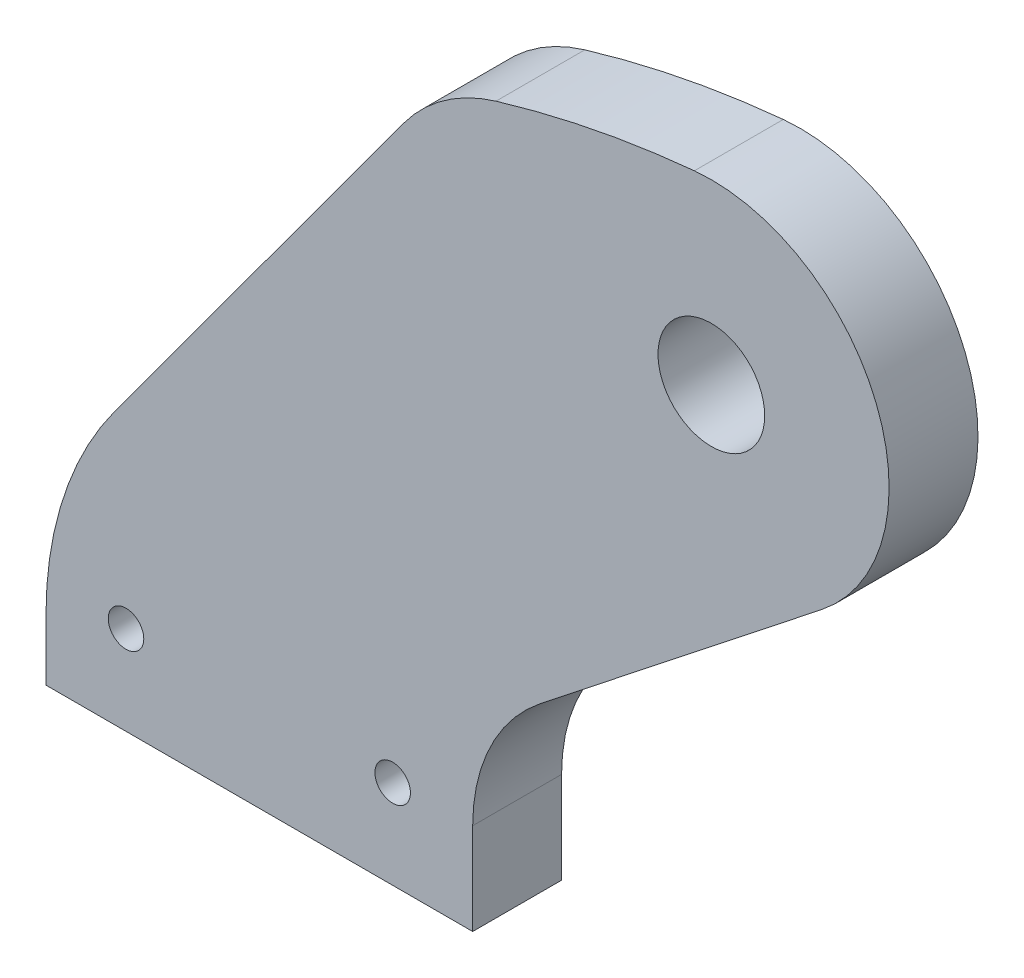
ISO-10303-21;
HEADER;
FILE_DESCRIPTION(('STEP AP214'),'2;1');
FILE_NAME('part.step','',(''),(''),'','','');
FILE_SCHEMA(('AUTOMOTIVE_DESIGN { 1 0 10303 214 1 1 1 1 }'));
ENDSEC;
DATA;
#1=APPLICATION_CONTEXT('core data for automotive mechanical design processes');
#2=APPLICATION_PROTOCOL_DEFINITION('international standard','automotive_design',2000,#1);
#3=PRODUCT_CONTEXT('',#1,'mechanical');
#4=PRODUCT('Part','Part','',(#3));
#5=PRODUCT_RELATED_PRODUCT_CATEGORY('part','',(#4));
#6=PRODUCT_DEFINITION_FORMATION('','',#4);
#7=PRODUCT_DEFINITION_CONTEXT('part definition',#1,'design');
#8=PRODUCT_DEFINITION('design','',#6,#7);
#9=PRODUCT_DEFINITION_SHAPE('','',#8);
#10=(LENGTH_UNIT() NAMED_UNIT(*) SI_UNIT(.MILLI.,.METRE.));
#11=(NAMED_UNIT(*) PLANE_ANGLE_UNIT() SI_UNIT($,.RADIAN.));
#12=(NAMED_UNIT(*) SI_UNIT($,.STERADIAN.) SOLID_ANGLE_UNIT());
#13=UNCERTAINTY_MEASURE_WITH_UNIT(LENGTH_MEASURE(1.E-05),#10,'distance_accuracy_value','');
#14=(GEOMETRIC_REPRESENTATION_CONTEXT(3) GLOBAL_UNCERTAINTY_ASSIGNED_CONTEXT((#13)) GLOBAL_UNIT_ASSIGNED_CONTEXT((#10,
#11,#12)) REPRESENTATION_CONTEXT('',''));
#15=CARTESIAN_POINT('',(0.,0.,0.));
#16=DIRECTION('',(0.,0.,1.));
#17=DIRECTION('',(1.,0.,0.));
#18=AXIS2_PLACEMENT_3D('',#15,#16,#17);
#19=CARTESIAN_POINT('',(5.08,2.19239495279308,3.175));
#20=DIRECTION('',(0.,0.,-1.));
#21=DIRECTION('',(-1.,0.,0.));
#22=AXIS2_PLACEMENT_3D('',#19,#20,#21);
#23=PLANE('',#22);
#24=CARTESIAN_POINT('',(16.1443298237358,21.1701142897261,3.175));
#25=DIRECTION('',(0.,0.,1.));
#26=DIRECTION('',(1.,0.,0.));
#27=AXIS2_PLACEMENT_3D('',#24,#25,#26);
#28=CIRCLE('',#27,1.905);
#29=CARTESIAN_POINT('',(18.0493298237358,21.1701142897261,3.175));
#30=VERTEX_POINT('',#29);
#31=EDGE_CURVE('E219',#30,#30,#28,.T.);
#32=ORIENTED_EDGE('',*,*,#31,.F.);
#33=EDGE_LOOP('',(#32));
#34=FACE_BOUND('',#33,.T.);
#35=CARTESIAN_POINT('',(-4.7625,3.175,3.175));
#36=DIRECTION('',(0.,0.,1.));
#37=DIRECTION('',(1.,0.,0.));
#38=AXIS2_PLACEMENT_3D('',#35,#36,#37);
#39=CIRCLE('',#38,0.635);
#40=CARTESIAN_POINT('',(-4.1275,3.175,3.175));
#41=VERTEX_POINT('',#40);
#42=EDGE_CURVE('E144',#41,#41,#39,.T.);
#43=ORIENTED_EDGE('',*,*,#42,.F.);
#44=EDGE_LOOP('',(#43));
#45=FACE_BOUND('',#44,.T.);
#46=DIRECTION('',(0.,-1.,0.));
#47=VECTOR('',#46,1.);
#48=CARTESIAN_POINT('',(-7.62,0.,3.175));
#49=LINE('',#48,#47);
#50=CARTESIAN_POINT('',(-7.62,2.19239495279308,3.175));
#51=VERTEX_POINT('',#50);
#52=CARTESIAN_POINT('',(-7.62,0.,3.175));
#53=VERTEX_POINT('',#52);
#54=EDGE_CURVE('E159',#51,#53,#49,.T.);
#55=ORIENTED_EDGE('',*,*,#54,.T.);
#56=DIRECTION('',(1.,0.,0.));
#57=VECTOR('',#56,1.);
#58=CARTESIAN_POINT('',(-7.62,0.,3.175));
#59=LINE('',#58,#57);
#60=CARTESIAN_POINT('',(7.62,0.,3.175));
#61=VERTEX_POINT('',#60);
#62=EDGE_CURVE('E97',#53,#61,#59,.T.);
#63=ORIENTED_EDGE('',*,*,#62,.T.);
#64=DIRECTION('',(0.,1.,0.));
#65=VECTOR('',#64,1.);
#66=CARTESIAN_POINT('',(7.62,3.27277767638108,3.175));
#67=LINE('',#66,#65);
#68=CARTESIAN_POINT('',(7.62,3.27277767638108,3.175));
#69=VERTEX_POINT('',#68);
#70=EDGE_CURVE('E180',#61,#69,#67,.T.);
#71=ORIENTED_EDGE('',*,*,#70,.T.);
#72=CARTESIAN_POINT('',(13.97,3.27277767638108,3.175));
#73=DIRECTION('',(0.,0.,-1.));
#74=DIRECTION('',(1.,0.,0.));
#75=AXIS2_PLACEMENT_3D('',#72,#73,#74);
#76=CIRCLE('',#75,6.35);
#77=CARTESIAN_POINT('',(10.0352587675232,8.25678323751833,3.175));
#78=VERTEX_POINT('',#77);
#79=EDGE_CURVE('E199',#69,#78,#76,.T.);
#80=ORIENTED_EDGE('',*,*,#79,.T.);
#81=DIRECTION('',(0.784882765533426,0.619644288579021,0.));
#82=VECTOR('',#81,1.);
#83=CARTESIAN_POINT('',(20.0790710562126,16.1861087285889,3.175));
#84=LINE('',#83,#82);
#85=CARTESIAN_POINT('',(20.0790710562126,16.1861087285889,3.175));
#86=VERTEX_POINT('',#85);
#87=EDGE_CURVE('E196',#78,#86,#84,.T.);
#88=ORIENTED_EDGE('',*,*,#87,.T.);
#89=CARTESIAN_POINT('',(16.1443298237358,21.1701142897261,3.175));
#90=DIRECTION('',(0.,0.,1.));
#91=DIRECTION('',(-1.,0.,0.));
#92=AXIS2_PLACEMENT_3D('',#89,#90,#91);
#93=CIRCLE('',#92,6.34999999999999);
#94=CARTESIAN_POINT('',(15.5389818703474,27.491194407501,3.175));
#95=VERTEX_POINT('',#94);
#96=EDGE_CURVE('E198',#86,#95,#93,.T.);
#97=ORIENTED_EDGE('',*,*,#96,.T.);
#98=CARTESIAN_POINT('',(19.05,-9.17107027559314,3.175));
#99=DIRECTION('',(0.,0.,1.));
#100=DIRECTION('',(-1.,0.,0.));
#101=AXIS2_PLACEMENT_3D('',#98,#99,#100);
#102=CIRCLE('',#101,36.83);
#103=CARTESIAN_POINT('',(8.45153460333413,26.1010352929106,3.175));
#104=VERTEX_POINT('',#103);
#105=EDGE_CURVE('E122',#95,#104,#102,.T.);
#106=ORIENTED_EDGE('',*,*,#105,.T.);
#107=CARTESIAN_POINT('',(10.2788562234489,20.0196377810996,3.175));
#108=DIRECTION('',(0.,0.,1.));
#109=DIRECTION('',(-1.,0.,0.));
#110=AXIS2_PLACEMENT_3D('',#107,#108,#109);
#111=CIRCLE('',#110,6.34999999999999);
#112=CARTESIAN_POINT('',(5.15818449976521,23.7747970451344,3.175));
#113=VERTEX_POINT('',#112);
#114=EDGE_CURVE('E116',#104,#113,#111,.T.);
#115=ORIENTED_EDGE('',*,*,#114,.T.);
#116=DIRECTION('',(-0.591363663627517,-0.806404995855706,0.));
#117=VECTOR('',#116,1.);
#118=CARTESIAN_POINT('',(-5.16134344736746,9.70271348086255,3.175));
#119=LINE('',#118,#117);
#120=CARTESIAN_POINT('',(-5.16134344736746,9.70271348086255,3.175));
#121=VERTEX_POINT('',#120);
#122=EDGE_CURVE('E120',#113,#121,#119,.T.);
#123=ORIENTED_EDGE('',*,*,#122,.T.);
#124=CARTESIAN_POINT('',(5.08,2.19239495279308,3.175));
#125=DIRECTION('',(0.,0.,1.));
#126=DIRECTION('',(-1.,0.,0.));
#127=AXIS2_PLACEMENT_3D('',#124,#125,#126);
#128=CIRCLE('',#127,12.7);
#129=EDGE_CURVE('E48',#121,#51,#128,.T.);
#130=ORIENTED_EDGE('',*,*,#129,.T.);
#131=EDGE_LOOP('',(#55,#63,#71,#80,#88,#97,#106,#115,#123,#130));
#132=FACE_BOUND('',#131,.T.);
#133=CARTESIAN_POINT('',(4.7625,3.175,3.175));
#134=DIRECTION('',(0.,0.,1.));
#135=DIRECTION('',(-1.,0.,0.));
#136=AXIS2_PLACEMENT_3D('',#133,#134,#135);
#137=CIRCLE('',#136,0.635);
#138=CARTESIAN_POINT('',(4.1275,3.175,3.175));
#139=VERTEX_POINT('',#138);
#140=EDGE_CURVE('E210',#139,#139,#137,.T.);
#141=ORIENTED_EDGE('',*,*,#140,.F.);
#142=EDGE_LOOP('',(#141));
#143=FACE_BOUND('',#142,.T.);
#144=ADVANCED_FACE('F31',(#34,#45,#132,#143),#23,.F.);
#145=CARTESIAN_POINT('',(5.08,2.19239495279308,0.));
#146=DIRECTION('',(0.,0.,-1.));
#147=DIRECTION('',(-1.,0.,0.));
#148=AXIS2_PLACEMENT_3D('',#145,#146,#147);
#149=PLANE('',#148);
#150=CARTESIAN_POINT('',(16.1443298237358,21.1701142897261,0.));
#151=DIRECTION('',(0.,0.,1.));
#152=DIRECTION('',(1.,0.,0.));
#153=AXIS2_PLACEMENT_3D('',#150,#151,#152);
#154=CIRCLE('',#153,1.905);
#155=CARTESIAN_POINT('',(18.0493298237358,21.1701142897261,0.));
#156=VERTEX_POINT('',#155);
#157=EDGE_CURVE('E216',#156,#156,#154,.T.);
#158=ORIENTED_EDGE('',*,*,#157,.T.);
#159=EDGE_LOOP('',(#158));
#160=FACE_BOUND('',#159,.T.);
#161=CARTESIAN_POINT('',(-4.7625,3.175,0.));
#162=DIRECTION('',(0.,0.,1.));
#163=DIRECTION('',(1.,0.,0.));
#164=AXIS2_PLACEMENT_3D('',#161,#162,#163);
#165=CIRCLE('',#164,0.635);
#166=CARTESIAN_POINT('',(-4.1275,3.175,0.));
#167=VERTEX_POINT('',#166);
#168=EDGE_CURVE('E207',#167,#167,#165,.T.);
#169=ORIENTED_EDGE('',*,*,#168,.T.);
#170=EDGE_LOOP('',(#169));
#171=FACE_BOUND('',#170,.T.);
#172=DIRECTION('',(0.,-1.,0.));
#173=VECTOR('',#172,1.);
#174=CARTESIAN_POINT('',(-7.62,0.,0.));
#175=LINE('',#174,#173);
#176=CARTESIAN_POINT('',(-7.62,2.19239495279308,0.));
#177=VERTEX_POINT('',#176);
#178=CARTESIAN_POINT('',(-7.62,0.,0.));
#179=VERTEX_POINT('',#178);
#180=EDGE_CURVE('E140',#177,#179,#175,.T.);
#181=ORIENTED_EDGE('',*,*,#180,.F.);
#182=CARTESIAN_POINT('',(5.08,2.19239495279308,0.));
#183=DIRECTION('',(0.,0.,1.));
#184=DIRECTION('',(-1.,0.,0.));
#185=AXIS2_PLACEMENT_3D('',#182,#183,#184);
#186=CIRCLE('',#185,12.7);
#187=CARTESIAN_POINT('',(-5.16134344736746,9.70271348086255,0.));
#188=VERTEX_POINT('',#187);
#189=EDGE_CURVE('E89',#188,#177,#186,.T.);
#190=ORIENTED_EDGE('',*,*,#189,.F.);
#191=DIRECTION('',(-0.591363663627517,-0.806404995855706,0.));
#192=VECTOR('',#191,1.);
#193=CARTESIAN_POINT('',(-5.16134344736746,9.70271348086255,0.));
#194=LINE('',#193,#192);
#195=CARTESIAN_POINT('',(5.15818449976521,23.7747970451344,0.));
#196=VERTEX_POINT('',#195);
#197=EDGE_CURVE('E83',#196,#188,#194,.T.);
#198=ORIENTED_EDGE('',*,*,#197,.F.);
#199=CARTESIAN_POINT('',(10.2788562234489,20.0196377810996,0.));
#200=DIRECTION('',(0.,0.,1.));
#201=DIRECTION('',(-1.,0.,0.));
#202=AXIS2_PLACEMENT_3D('',#199,#200,#201);
#203=CIRCLE('',#202,6.34999999999999);
#204=CARTESIAN_POINT('',(8.45153460333413,26.1010352929106,0.));
#205=VERTEX_POINT('',#204);
#206=EDGE_CURVE('E130',#205,#196,#203,.T.);
#207=ORIENTED_EDGE('',*,*,#206,.F.);
#208=CARTESIAN_POINT('',(19.05,-9.17107027559314,0.));
#209=DIRECTION('',(0.,0.,1.));
#210=DIRECTION('',(-1.,0.,0.));
#211=AXIS2_PLACEMENT_3D('',#208,#209,#210);
#212=CIRCLE('',#211,36.83);
#213=CARTESIAN_POINT('',(15.5389818703474,27.491194407501,0.));
#214=VERTEX_POINT('',#213);
#215=EDGE_CURVE('E154',#214,#205,#212,.T.);
#216=ORIENTED_EDGE('',*,*,#215,.F.);
#217=CARTESIAN_POINT('',(16.1443298237358,21.1701142897261,0.));
#218=DIRECTION('',(0.,0.,1.));
#219=DIRECTION('',(-1.,0.,0.));
#220=AXIS2_PLACEMENT_3D('',#217,#218,#219);
#221=CIRCLE('',#220,6.34999999999999);
#222=CARTESIAN_POINT('',(20.0790710562126,16.1861087285889,0.));
#223=VERTEX_POINT('',#222);
#224=EDGE_CURVE('E152',#223,#214,#221,.T.);
#225=ORIENTED_EDGE('',*,*,#224,.F.);
#226=DIRECTION('',(0.784882765533426,0.619644288579021,0.));
#227=VECTOR('',#226,1.);
#228=CARTESIAN_POINT('',(20.0790710562126,16.1861087285889,0.));
#229=LINE('',#228,#227);
#230=CARTESIAN_POINT('',(10.0352587675232,8.25678323751833,0.));
#231=VERTEX_POINT('',#230);
#232=EDGE_CURVE('E150',#231,#223,#229,.T.);
#233=ORIENTED_EDGE('',*,*,#232,.F.);
#234=CARTESIAN_POINT('',(13.97,3.27277767638108,0.));
#235=DIRECTION('',(0.,0.,-1.));
#236=DIRECTION('',(1.,0.,0.));
#237=AXIS2_PLACEMENT_3D('',#234,#235,#236);
#238=CIRCLE('',#237,6.35);
#239=CARTESIAN_POINT('',(7.62,3.27277767638108,0.));
#240=VERTEX_POINT('',#239);
#241=EDGE_CURVE('E148',#240,#231,#238,.T.);
#242=ORIENTED_EDGE('',*,*,#241,.F.);
#243=DIRECTION('',(0.,1.,0.));
#244=VECTOR('',#243,1.);
#245=CARTESIAN_POINT('',(7.62,3.27277767638108,0.));
#246=LINE('',#245,#244);
#247=CARTESIAN_POINT('',(7.62,0.,0.));
#248=VERTEX_POINT('',#247);
#249=EDGE_CURVE('E146',#248,#240,#246,.T.);
#250=ORIENTED_EDGE('',*,*,#249,.F.);
#251=DIRECTION('',(1.,0.,0.));
#252=VECTOR('',#251,1.);
#253=CARTESIAN_POINT('',(-7.62,0.,0.));
#254=LINE('',#253,#252);
#255=EDGE_CURVE('E143',#179,#248,#254,.T.);
#256=ORIENTED_EDGE('',*,*,#255,.F.);
#257=EDGE_LOOP('',(#181,#190,#198,#207,#216,#225,#233,#242,#250,#256));
#258=FACE_BOUND('',#257,.T.);
#259=CARTESIAN_POINT('',(4.7625,3.175,0.));
#260=DIRECTION('',(0.,0.,1.));
#261=DIRECTION('',(-1.,0.,0.));
#262=AXIS2_PLACEMENT_3D('',#259,#260,#261);
#263=CIRCLE('',#262,0.635);
#264=CARTESIAN_POINT('',(4.1275,3.175,0.));
#265=VERTEX_POINT('',#264);
#266=EDGE_CURVE('E213',#265,#265,#263,.T.);
#267=ORIENTED_EDGE('',*,*,#266,.T.);
#268=EDGE_LOOP('',(#267));
#269=FACE_BOUND('',#268,.T.);
#270=ADVANCED_FACE('F184',(#160,#171,#258,#269),#149,.T.);
#271=CARTESIAN_POINT('',(-7.62,0.,3.175));
#272=DIRECTION('',(1.,0.,0.));
#273=DIRECTION('',(0.,1.,0.));
#274=AXIS2_PLACEMENT_3D('',#271,#272,#273);
#275=PLANE('',#274);
#276=ORIENTED_EDGE('',*,*,#180,.T.);
#277=DIRECTION('',(0.,0.,-1.));
#278=VECTOR('',#277,1.);
#279=CARTESIAN_POINT('',(-7.62,0.,3.175));
#280=LINE('',#279,#278);
#281=EDGE_CURVE('E11',#53,#179,#280,.T.);
#282=ORIENTED_EDGE('',*,*,#281,.F.);
#283=ORIENTED_EDGE('',*,*,#54,.F.);
#284=DIRECTION('',(0.,0.,-1.));
#285=VECTOR('',#284,1.);
#286=CARTESIAN_POINT('',(-7.62,2.19239495279308,3.175));
#287=LINE('',#286,#285);
#288=EDGE_CURVE('E136',#51,#177,#287,.T.);
#289=ORIENTED_EDGE('',*,*,#288,.T.);
#290=EDGE_LOOP('',(#276,#282,#283,#289));
#291=FACE_BOUND('',#290,.T.);
#292=ADVANCED_FACE('F33',(#291),#275,.F.);
#293=CARTESIAN_POINT('',(-7.62,0.,3.175));
#294=DIRECTION('',(0.,1.,0.));
#295=DIRECTION('',(0.,0.,1.));
#296=AXIS2_PLACEMENT_3D('',#293,#294,#295);
#297=PLANE('',#296);
#298=ORIENTED_EDGE('',*,*,#255,.T.);
#299=DIRECTION('',(0.,0.,-1.));
#300=VECTOR('',#299,1.);
#301=CARTESIAN_POINT('',(7.62,0.,3.175));
#302=LINE('',#301,#300);
#303=EDGE_CURVE('E40',#61,#248,#302,.T.);
#304=ORIENTED_EDGE('',*,*,#303,.F.);
#305=ORIENTED_EDGE('',*,*,#62,.F.);
#306=ORIENTED_EDGE('',*,*,#281,.T.);
#307=EDGE_LOOP('',(#298,#304,#305,#306));
#308=FACE_BOUND('',#307,.T.);
#309=ADVANCED_FACE('F250',(#308),#297,.F.);
#310=CARTESIAN_POINT('',(7.62,3.27277767638108,3.175));
#311=DIRECTION('',(-1.,0.,0.));
#312=DIRECTION('',(0.,-1.,0.));
#313=AXIS2_PLACEMENT_3D('',#310,#311,#312);
#314=PLANE('',#313);
#315=ORIENTED_EDGE('',*,*,#249,.T.);
#316=DIRECTION('',(0.,0.,-1.));
#317=VECTOR('',#316,1.);
#318=CARTESIAN_POINT('',(7.62,3.27277767638108,3.175));
#319=LINE('',#318,#317);
#320=EDGE_CURVE('E172',#69,#240,#319,.T.);
#321=ORIENTED_EDGE('',*,*,#320,.F.);
#322=ORIENTED_EDGE('',*,*,#70,.F.);
#323=ORIENTED_EDGE('',*,*,#303,.T.);
#324=EDGE_LOOP('',(#315,#321,#322,#323));
#325=FACE_BOUND('',#324,.T.);
#326=ADVANCED_FACE('F178',(#325),#314,.F.);
#327=CARTESIAN_POINT('',(13.97,3.27277767638108,3.175));
#328=DIRECTION('',(0.,0.,-1.));
#329=DIRECTION('',(-1.,0.,0.));
#330=AXIS2_PLACEMENT_3D('',#327,#328,#329);
#331=CYLINDRICAL_SURFACE('',#330,6.35);
#332=ORIENTED_EDGE('',*,*,#241,.T.);
#333=DIRECTION('',(0.,0.,-1.));
#334=VECTOR('',#333,1.);
#335=CARTESIAN_POINT('',(10.0352587675232,8.25678323751833,3.175));
#336=LINE('',#335,#334);
#337=EDGE_CURVE('E169',#78,#231,#336,.T.);
#338=ORIENTED_EDGE('',*,*,#337,.F.);
#339=ORIENTED_EDGE('',*,*,#79,.F.);
#340=ORIENTED_EDGE('',*,*,#320,.T.);
#341=EDGE_LOOP('',(#332,#338,#339,#340));
#342=FACE_BOUND('',#341,.T.);
#343=ADVANCED_FACE('F190',(#342),#331,.F.);
#344=CARTESIAN_POINT('',(20.0790710562126,16.1861087285889,3.175));
#345=DIRECTION('',(-0.619644288579021,0.784882765533426,0.));
#346=DIRECTION('',(-0.784882765533426,-0.619644288579021,0.));
#347=AXIS2_PLACEMENT_3D('',#344,#345,#346);
#348=PLANE('',#347);
#349=ORIENTED_EDGE('',*,*,#232,.T.);
#350=DIRECTION('',(0.,0.,-1.));
#351=VECTOR('',#350,1.);
#352=CARTESIAN_POINT('',(20.0790710562126,16.1861087285889,3.175));
#353=LINE('',#352,#351);
#354=EDGE_CURVE('E166',#86,#223,#353,.T.);
#355=ORIENTED_EDGE('',*,*,#354,.F.);
#356=ORIENTED_EDGE('',*,*,#87,.F.);
#357=ORIENTED_EDGE('',*,*,#337,.T.);
#358=EDGE_LOOP('',(#349,#355,#356,#357));
#359=FACE_BOUND('',#358,.T.);
#360=ADVANCED_FACE('F194',(#359),#348,.F.);
#361=CARTESIAN_POINT('',(16.1443298237358,21.1701142897261,3.175));
#362=DIRECTION('',(0.,0.,-1.));
#363=DIRECTION('',(-1.,0.,0.));
#364=AXIS2_PLACEMENT_3D('',#361,#362,#363);
#365=CYLINDRICAL_SURFACE('',#364,6.34999999999999);
#366=ORIENTED_EDGE('',*,*,#224,.T.);
#367=DIRECTION('',(0.,0.,-1.));
#368=VECTOR('',#367,1.);
#369=CARTESIAN_POINT('',(15.5389818703474,27.491194407501,3.175));
#370=LINE('',#369,#368);
#371=EDGE_CURVE('E163',#95,#214,#370,.T.);
#372=ORIENTED_EDGE('',*,*,#371,.F.);
#373=ORIENTED_EDGE('',*,*,#96,.F.);
#374=ORIENTED_EDGE('',*,*,#354,.T.);
#375=EDGE_LOOP('',(#366,#372,#373,#374));
#376=FACE_BOUND('',#375,.T.);
#377=ADVANCED_FACE('F262',(#376),#365,.T.);
#378=CARTESIAN_POINT('',(19.05,-9.17107027559314,3.175));
#379=DIRECTION('',(0.,0.,-1.));
#380=DIRECTION('',(-1.,0.,0.));
#381=AXIS2_PLACEMENT_3D('',#378,#379,#380);
#382=CYLINDRICAL_SURFACE('',#381,36.83);
#383=ORIENTED_EDGE('',*,*,#215,.T.);
#384=DIRECTION('',(0.,0.,-1.));
#385=VECTOR('',#384,1.);
#386=CARTESIAN_POINT('',(8.45153460333413,26.1010352929106,3.175));
#387=LINE('',#386,#385);
#388=EDGE_CURVE('E131',#104,#205,#387,.T.);
#389=ORIENTED_EDGE('',*,*,#388,.F.);
#390=ORIENTED_EDGE('',*,*,#105,.F.);
#391=ORIENTED_EDGE('',*,*,#371,.T.);
#392=EDGE_LOOP('',(#383,#389,#390,#391));
#393=FACE_BOUND('',#392,.T.);
#394=ADVANCED_FACE('F259',(#393),#382,.T.);
#395=CARTESIAN_POINT('',(10.2788562234489,20.0196377810996,3.175));
#396=DIRECTION('',(0.,0.,-1.));
#397=DIRECTION('',(-1.,0.,0.));
#398=AXIS2_PLACEMENT_3D('',#395,#396,#397);
#399=CYLINDRICAL_SURFACE('',#398,6.34999999999999);
#400=ORIENTED_EDGE('',*,*,#206,.T.);
#401=DIRECTION('',(0.,0.,-1.));
#402=VECTOR('',#401,1.);
#403=CARTESIAN_POINT('',(5.15818449976521,23.7747970451344,3.175));
#404=LINE('',#403,#402);
#405=EDGE_CURVE('E127',#113,#196,#404,.T.);
#406=ORIENTED_EDGE('',*,*,#405,.F.);
#407=ORIENTED_EDGE('',*,*,#114,.F.);
#408=ORIENTED_EDGE('',*,*,#388,.T.);
#409=EDGE_LOOP('',(#400,#406,#407,#408));
#410=FACE_BOUND('',#409,.T.);
#411=ADVANCED_FACE('F128',(#410),#399,.T.);
#412=CARTESIAN_POINT('',(-5.16134344736746,9.70271348086255,3.175));
#413=DIRECTION('',(0.806404995855706,-0.591363663627517,0.));
#414=DIRECTION('',(0.591363663627517,0.806404995855706,0.));
#415=AXIS2_PLACEMENT_3D('',#412,#413,#414);
#416=PLANE('',#415);
#417=ORIENTED_EDGE('',*,*,#197,.T.);
#418=DIRECTION('',(0.,0.,-1.));
#419=VECTOR('',#418,1.);
#420=CARTESIAN_POINT('',(-5.16134344736746,9.70271348086255,3.175));
#421=LINE('',#420,#419);
#422=EDGE_CURVE('E132',#121,#188,#421,.T.);
#423=ORIENTED_EDGE('',*,*,#422,.F.);
#424=ORIENTED_EDGE('',*,*,#122,.F.);
#425=ORIENTED_EDGE('',*,*,#405,.T.);
#426=EDGE_LOOP('',(#417,#423,#424,#425));
#427=FACE_BOUND('',#426,.T.);
#428=ADVANCED_FACE('F134',(#427),#416,.F.);
#429=CARTESIAN_POINT('',(5.08,2.19239495279308,3.175));
#430=DIRECTION('',(0.,0.,-1.));
#431=DIRECTION('',(-1.,0.,0.));
#432=AXIS2_PLACEMENT_3D('',#429,#430,#431);
#433=CYLINDRICAL_SURFACE('',#432,12.7);
#434=ORIENTED_EDGE('',*,*,#189,.T.);
#435=ORIENTED_EDGE('',*,*,#288,.F.);
#436=ORIENTED_EDGE('',*,*,#129,.F.);
#437=ORIENTED_EDGE('',*,*,#422,.T.);
#438=EDGE_LOOP('',(#434,#435,#436,#437));
#439=FACE_BOUND('',#438,.T.);
#440=ADVANCED_FACE('F242',(#439),#433,.T.);
#441=CARTESIAN_POINT('',(-4.7625,3.175,3.175));
#442=DIRECTION('',(0.,0.,-1.));
#443=DIRECTION('',(-1.,0.,0.));
#444=AXIS2_PLACEMENT_3D('',#441,#442,#443);
#445=CYLINDRICAL_SURFACE('',#444,0.635);
#446=ORIENTED_EDGE('',*,*,#42,.T.);
#447=EDGE_LOOP('',(#446));
#448=FACE_BOUND('',#447,.T.);
#449=ORIENTED_EDGE('',*,*,#168,.F.);
#450=EDGE_LOOP('',(#449));
#451=FACE_BOUND('',#450,.T.);
#452=ADVANCED_FACE('F239',(#448,#451),#445,.F.);
#453=CARTESIAN_POINT('',(4.7625,3.175,3.175));
#454=DIRECTION('',(0.,0.,-1.));
#455=DIRECTION('',(-1.,0.,0.));
#456=AXIS2_PLACEMENT_3D('',#453,#454,#455);
#457=CYLINDRICAL_SURFACE('',#456,0.635);
#458=ORIENTED_EDGE('',*,*,#140,.T.);
#459=EDGE_LOOP('',(#458));
#460=FACE_BOUND('',#459,.T.);
#461=ORIENTED_EDGE('',*,*,#266,.F.);
#462=EDGE_LOOP('',(#461));
#463=FACE_BOUND('',#462,.T.);
#464=ADVANCED_FACE('F230',(#460,#463),#457,.F.);
#465=CARTESIAN_POINT('',(16.1443298237358,21.1701142897261,0.));
#466=DIRECTION('',(0.,0.,1.));
#467=DIRECTION('',(1.,0.,0.));
#468=AXIS2_PLACEMENT_3D('',#465,#466,#467);
#469=CYLINDRICAL_SURFACE('',#468,1.905);
#470=ORIENTED_EDGE('',*,*,#157,.F.);
#471=EDGE_LOOP('',(#470));
#472=FACE_BOUND('',#471,.T.);
#473=ORIENTED_EDGE('',*,*,#31,.T.);
#474=EDGE_LOOP('',(#473));
#475=FACE_BOUND('',#474,.T.);
#476=ADVANCED_FACE('F227',(#472,#475),#469,.F.);
#477=CLOSED_SHELL('',(#144,#270,#292,#309,#326,#343,#360,#377,#394,#411,#428,#440,#452,#464,#476));
#478=MANIFOLD_SOLID_BREP('B2',#477);
#479=ADVANCED_BREP_SHAPE_REPRESENTATION('',(#18,#478),#14);
#480=SHAPE_DEFINITION_REPRESENTATION(#9,#479);
ENDSEC;
END-ISO-10303-21;
